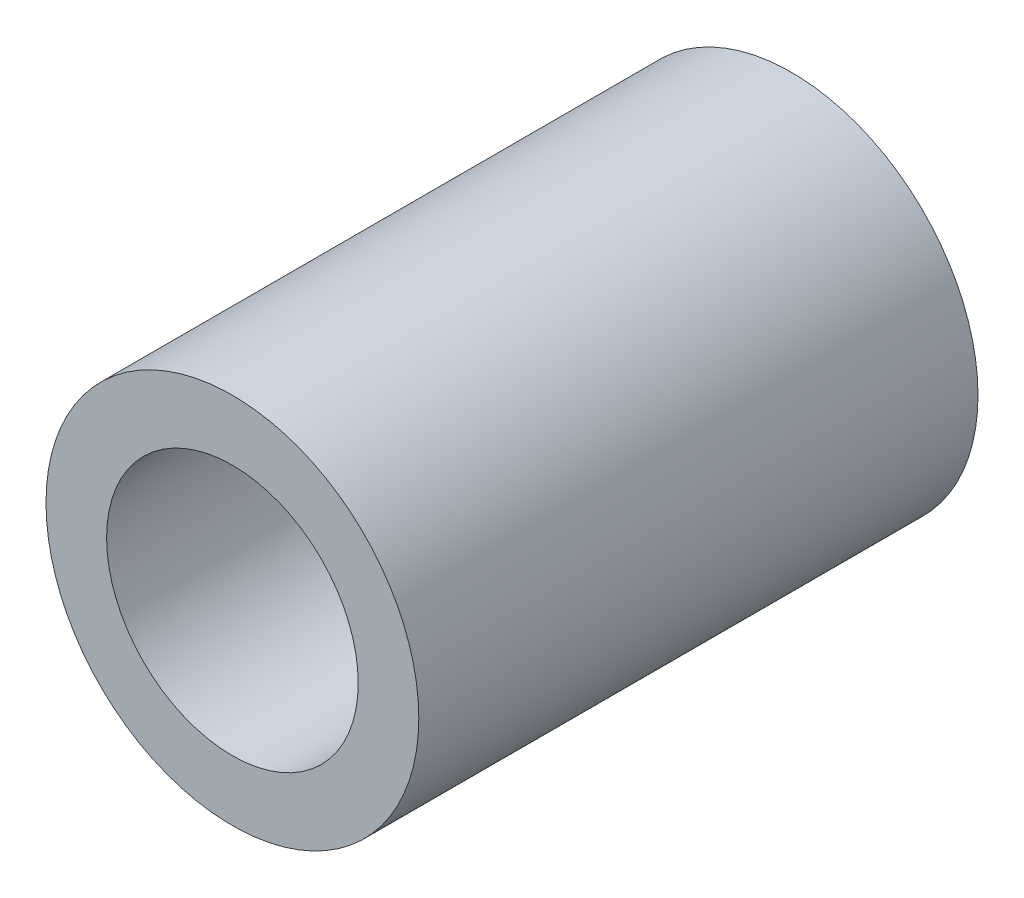
ISO-10303-21;
HEADER;
FILE_DESCRIPTION(('STEP AP214'),'2;1');
FILE_NAME('part.step','',(''),(''),'','','');
FILE_SCHEMA(('AUTOMOTIVE_DESIGN { 1 0 10303 214 1 1 1 1 }'));
ENDSEC;
DATA;
#1=APPLICATION_CONTEXT('core data for automotive mechanical design processes');
#2=APPLICATION_PROTOCOL_DEFINITION('international standard','automotive_design',2000,#1);
#3=PRODUCT_CONTEXT('',#1,'mechanical');
#4=PRODUCT('Part','Part','',(#3));
#5=PRODUCT_RELATED_PRODUCT_CATEGORY('part','',(#4));
#6=PRODUCT_DEFINITION_FORMATION('','',#4);
#7=PRODUCT_DEFINITION_CONTEXT('part definition',#1,'design');
#8=PRODUCT_DEFINITION('design','',#6,#7);
#9=PRODUCT_DEFINITION_SHAPE('','',#8);
#10=(LENGTH_UNIT() NAMED_UNIT(*) SI_UNIT(.MILLI.,.METRE.));
#11=(NAMED_UNIT(*) PLANE_ANGLE_UNIT() SI_UNIT($,.RADIAN.));
#12=(NAMED_UNIT(*) SI_UNIT($,.STERADIAN.) SOLID_ANGLE_UNIT());
#13=UNCERTAINTY_MEASURE_WITH_UNIT(LENGTH_MEASURE(1.E-05),#10,'distance_accuracy_value','');
#14=(GEOMETRIC_REPRESENTATION_CONTEXT(3) GLOBAL_UNCERTAINTY_ASSIGNED_CONTEXT((#13)) GLOBAL_UNIT_ASSIGNED_CONTEXT((#10,
#11,#12)) REPRESENTATION_CONTEXT('',''));
#15=CARTESIAN_POINT('',(0.,0.,0.));
#16=DIRECTION('',(0.,0.,1.));
#17=DIRECTION('',(1.,0.,0.));
#18=AXIS2_PLACEMENT_3D('',#15,#16,#17);
#19=CARTESIAN_POINT('',(0.,0.,6.));
#20=DIRECTION('',(0.,0.,1.));
#21=DIRECTION('',(1.,0.,0.));
#22=AXIS2_PLACEMENT_3D('',#19,#20,#21);
#23=PLANE('',#22);
#24=CARTESIAN_POINT('',(0.,0.,6.));
#25=DIRECTION('',(0.,0.,1.));
#26=DIRECTION('',(1.,0.,0.));
#27=AXIS2_PLACEMENT_3D('',#24,#25,#26);
#28=CIRCLE('',#27,2.);
#29=CARTESIAN_POINT('',(2.,0.,6.));
#30=VERTEX_POINT('',#29);
#31=EDGE_CURVE('E10',#30,#30,#28,.T.);
#32=ORIENTED_EDGE('',*,*,#31,.T.);
#33=EDGE_LOOP('',(#32));
#34=FACE_BOUND('',#33,.T.);
#35=CARTESIAN_POINT('',(0.,0.,6.));
#36=DIRECTION('',(0.,0.,1.));
#37=DIRECTION('',(1.,0.,0.));
#38=AXIS2_PLACEMENT_3D('',#35,#36,#37);
#39=CIRCLE('',#38,1.35);
#40=CARTESIAN_POINT('',(1.35,0.,6.));
#41=VERTEX_POINT('',#40);
#42=EDGE_CURVE('E44',#41,#41,#39,.T.);
#43=ORIENTED_EDGE('',*,*,#42,.F.);
#44=EDGE_LOOP('',(#43));
#45=FACE_BOUND('',#44,.T.);
#46=ADVANCED_FACE('F33',(#34,#45),#23,.T.);
#47=CARTESIAN_POINT('',(0.,0.,0.));
#48=DIRECTION('',(0.,0.,1.));
#49=DIRECTION('',(1.,0.,0.));
#50=AXIS2_PLACEMENT_3D('',#47,#48,#49);
#51=PLANE('',#50);
#52=CARTESIAN_POINT('',(0.,0.,0.));
#53=DIRECTION('',(0.,0.,1.));
#54=DIRECTION('',(1.,0.,0.));
#55=AXIS2_PLACEMENT_3D('',#52,#53,#54);
#56=CIRCLE('',#55,2.);
#57=CARTESIAN_POINT('',(2.,0.,0.));
#58=VERTEX_POINT('',#57);
#59=EDGE_CURVE('E37',#58,#58,#56,.T.);
#60=ORIENTED_EDGE('',*,*,#59,.F.);
#61=EDGE_LOOP('',(#60));
#62=FACE_BOUND('',#61,.T.);
#63=CARTESIAN_POINT('',(0.,0.,0.));
#64=DIRECTION('',(0.,0.,1.));
#65=DIRECTION('',(1.,0.,0.));
#66=AXIS2_PLACEMENT_3D('',#63,#64,#65);
#67=CIRCLE('',#66,1.35);
#68=CARTESIAN_POINT('',(1.35,0.,0.));
#69=VERTEX_POINT('',#68);
#70=EDGE_CURVE('E46',#69,#69,#67,.T.);
#71=ORIENTED_EDGE('',*,*,#70,.T.);
#72=EDGE_LOOP('',(#71));
#73=FACE_BOUND('',#72,.T.);
#74=ADVANCED_FACE('F56',(#62,#73),#51,.F.);
#75=CARTESIAN_POINT('',(0.,0.,6.));
#76=DIRECTION('',(0.,0.,-1.));
#77=DIRECTION('',(-1.,0.,0.));
#78=AXIS2_PLACEMENT_3D('',#75,#76,#77);
#79=CYLINDRICAL_SURFACE('',#78,2.);
#80=ORIENTED_EDGE('',*,*,#31,.F.);
#81=EDGE_LOOP('',(#80));
#82=FACE_BOUND('',#81,.T.);
#83=ORIENTED_EDGE('',*,*,#59,.T.);
#84=EDGE_LOOP('',(#83));
#85=FACE_BOUND('',#84,.T.);
#86=ADVANCED_FACE('F35',(#82,#85),#79,.T.);
#87=CARTESIAN_POINT('',(0.,0.,6.));
#88=DIRECTION('',(0.,0.,-1.));
#89=DIRECTION('',(-1.,0.,0.));
#90=AXIS2_PLACEMENT_3D('',#87,#88,#89);
#91=CYLINDRICAL_SURFACE('',#90,1.35);
#92=ORIENTED_EDGE('',*,*,#42,.T.);
#93=EDGE_LOOP('',(#92));
#94=FACE_BOUND('',#93,.T.);
#95=ORIENTED_EDGE('',*,*,#70,.F.);
#96=EDGE_LOOP('',(#95));
#97=FACE_BOUND('',#96,.T.);
#98=ADVANCED_FACE('F52',(#94,#97),#91,.F.);
#99=CLOSED_SHELL('',(#46,#74,#86,#98));
#100=MANIFOLD_SOLID_BREP('B2',#99);
#101=ADVANCED_BREP_SHAPE_REPRESENTATION('',(#18,#100),#14);
#102=SHAPE_DEFINITION_REPRESENTATION(#9,#101);
ENDSEC;
END-ISO-10303-21;
